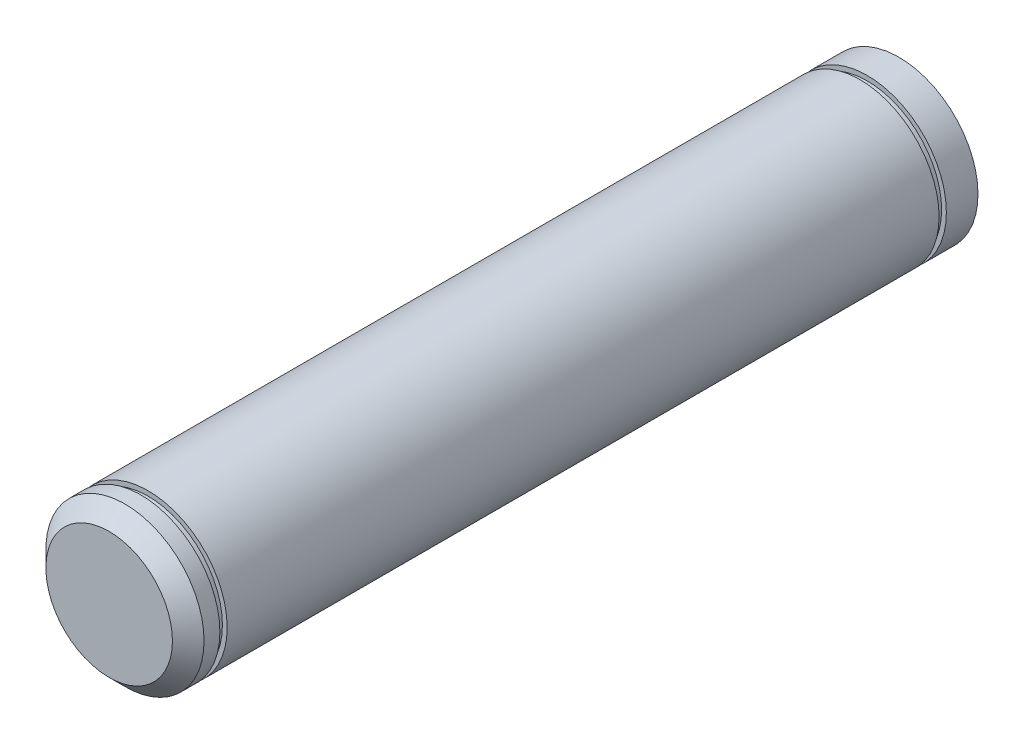
ISO-10303-21;
HEADER;
FILE_DESCRIPTION(('STEP AP214'),'2;1');
FILE_NAME('part.step','',(''),(''),'','','');
FILE_SCHEMA(('AUTOMOTIVE_DESIGN { 1 0 10303 214 1 1 1 1 }'));
ENDSEC;
DATA;
#1=APPLICATION_CONTEXT('core data for automotive mechanical design processes');
#2=APPLICATION_PROTOCOL_DEFINITION('international standard','automotive_design',2000,#1);
#3=PRODUCT_CONTEXT('',#1,'mechanical');
#4=PRODUCT('Part','Part','',(#3));
#5=PRODUCT_RELATED_PRODUCT_CATEGORY('part','',(#4));
#6=PRODUCT_DEFINITION_FORMATION('','',#4);
#7=PRODUCT_DEFINITION_CONTEXT('part definition',#1,'design');
#8=PRODUCT_DEFINITION('design','',#6,#7);
#9=PRODUCT_DEFINITION_SHAPE('','',#8);
#10=(LENGTH_UNIT() NAMED_UNIT(*) SI_UNIT(.MILLI.,.METRE.));
#11=(NAMED_UNIT(*) PLANE_ANGLE_UNIT() SI_UNIT($,.RADIAN.));
#12=(NAMED_UNIT(*) SI_UNIT($,.STERADIAN.) SOLID_ANGLE_UNIT());
#13=UNCERTAINTY_MEASURE_WITH_UNIT(LENGTH_MEASURE(1.E-05),#10,'distance_accuracy_value','');
#14=(GEOMETRIC_REPRESENTATION_CONTEXT(3) GLOBAL_UNCERTAINTY_ASSIGNED_CONTEXT((#13)) GLOBAL_UNIT_ASSIGNED_CONTEXT((#10,
#11,#12)) REPRESENTATION_CONTEXT('',''));
#15=CARTESIAN_POINT('',(0.,0.,0.));
#16=DIRECTION('',(0.,0.,1.));
#17=DIRECTION('',(1.,0.,0.));
#18=AXIS2_PLACEMENT_3D('',#15,#16,#17);
#19=CARTESIAN_POINT('',(0.,0.,304.8));
#20=DIRECTION('',(0.,0.,-1.));
#21=DIRECTION('',(-1.,0.,0.));
#22=AXIS2_PLACEMENT_3D('',#19,#20,#21);
#23=CYLINDRICAL_SURFACE('',#22,12.7);
#24=CARTESIAN_POINT('',(0.,0.,298.5516));
#25=DIRECTION('',(0.,0.,1.));
#26=DIRECTION('',(1.,0.,0.));
#27=AXIS2_PLACEMENT_3D('',#24,#25,#26);
#28=CIRCLE('',#27,12.7);
#29=CARTESIAN_POINT('',(12.7,0.,298.5516));
#30=VERTEX_POINT('',#29);
#31=EDGE_CURVE('E47',#30,#30,#28,.T.);
#32=ORIENTED_EDGE('',*,*,#31,.F.);
#33=EDGE_LOOP('',(#32));
#34=FACE_BOUND('',#33,.T.);
#35=CARTESIAN_POINT('',(0.,0.,184.248400108));
#36=DIRECTION('',(0.,0.,1.));
#37=DIRECTION('',(1.,0.,0.));
#38=AXIS2_PLACEMENT_3D('',#35,#36,#37);
#39=CIRCLE('',#38,12.7);
#40=CARTESIAN_POINT('',(12.7,0.,184.248400108));
#41=VERTEX_POINT('',#40);
#42=EDGE_CURVE('E59',#41,#41,#39,.T.);
#43=ORIENTED_EDGE('',*,*,#42,.T.);
#44=EDGE_LOOP('',(#43));
#45=FACE_BOUND('',#44,.T.);
#46=ADVANCED_FACE('F32',(#34,#45),#23,.T.);
#47=CARTESIAN_POINT('',(0.,0.,299.72));
#48=DIRECTION('',(0.,0.,1.));
#49=DIRECTION('',(1.,0.,0.));
#50=AXIS2_PLACEMENT_3D('',#47,#48,#49);
#51=CIRCLE('',#50,12.7);
#52=CARTESIAN_POINT('',(12.7,0.,299.72));
#53=VERTEX_POINT('',#52);
#54=EDGE_CURVE('E50',#53,#53,#51,.T.);
#55=ORIENTED_EDGE('',*,*,#54,.T.);
#56=EDGE_LOOP('',(#55));
#57=FACE_BOUND('',#56,.T.);
#58=CARTESIAN_POINT('',(0.,0.,302.26));
#59=DIRECTION('',(0.,0.,1.));
#60=DIRECTION('',(1.,0.,0.));
#61=AXIS2_PLACEMENT_3D('',#58,#59,#60);
#62=CIRCLE('',#61,12.7);
#63=CARTESIAN_POINT('',(12.7,0.,302.26));
#64=VERTEX_POINT('',#63);
#65=EDGE_CURVE('E39',#64,#64,#62,.F.);
#66=ORIENTED_EDGE('',*,*,#65,.T.);
#67=EDGE_LOOP('',(#66));
#68=FACE_BOUND('',#67,.T.);
#69=ADVANCED_FACE('F95',(#57,#68),#23,.T.);
#70=CARTESIAN_POINT('',(0.,0.,304.8));
#71=DIRECTION('',(0.,0.,1.));
#72=DIRECTION('',(1.,0.,0.));
#73=AXIS2_PLACEMENT_3D('',#70,#71,#72);
#74=PLANE('',#73);
#75=CARTESIAN_POINT('',(0.,0.,304.8));
#76=DIRECTION('',(0.,0.,1.));
#77=DIRECTION('',(1.,0.,0.));
#78=AXIS2_PLACEMENT_3D('',#75,#76,#77);
#79=CIRCLE('',#78,10.1600000000003);
#80=CARTESIAN_POINT('',(10.1600000000003,0.,304.8));
#81=VERTEX_POINT('',#80);
#82=EDGE_CURVE('E10',#81,#81,#79,.T.);
#83=ORIENTED_EDGE('',*,*,#82,.T.);
#84=EDGE_LOOP('',(#83));
#85=FACE_BOUND('',#84,.T.);
#86=ADVANCED_FACE('F101',(#85),#74,.T.);
#87=CARTESIAN_POINT('',(0.,0.,304.8));
#88=DIRECTION('',(0.,0.,-1.));
#89=DIRECTION('',(-1.,0.,0.));
#90=AXIS2_PLACEMENT_3D('',#87,#88,#89);
#91=CONICAL_SURFACE('',#90,10.1600000000003,0.785398163397451);
#92=ORIENTED_EDGE('',*,*,#65,.F.);
#93=EDGE_LOOP('',(#92));
#94=FACE_BOUND('',#93,.T.);
#95=ORIENTED_EDGE('',*,*,#82,.F.);
#96=EDGE_LOOP('',(#95));
#97=FACE_BOUND('',#96,.T.);
#98=ADVANCED_FACE('F34',(#94,#97),#91,.T.);
#99=CARTESIAN_POINT('',(0.,0.,298.5516));
#100=DIRECTION('',(0.,0.,1.));
#101=DIRECTION('',(1.,0.,0.));
#102=AXIS2_PLACEMENT_3D('',#99,#100,#101);
#103=PLANE('',#102);
#104=CARTESIAN_POINT('',(0.,0.,298.5516));
#105=DIRECTION('',(0.,0.,1.));
#106=DIRECTION('',(1.,0.,0.));
#107=AXIS2_PLACEMENT_3D('',#104,#105,#106);
#108=CIRCLE('',#107,11.938);
#109=CARTESIAN_POINT('',(11.938,0.,298.5516));
#110=VERTEX_POINT('',#109);
#111=EDGE_CURVE('E53',#110,#110,#108,.T.);
#112=ORIENTED_EDGE('',*,*,#111,.F.);
#113=EDGE_LOOP('',(#112));
#114=FACE_BOUND('',#113,.T.);
#115=ORIENTED_EDGE('',*,*,#31,.T.);
#116=EDGE_LOOP('',(#115));
#117=FACE_BOUND('',#116,.T.);
#118=ADVANCED_FACE('F125',(#114,#117),#103,.T.);
#119=CARTESIAN_POINT('',(0.,0.,299.72));
#120=DIRECTION('',(0.,0.,1.));
#121=DIRECTION('',(1.,0.,0.));
#122=AXIS2_PLACEMENT_3D('',#119,#120,#121);
#123=PLANE('',#122);
#124=CARTESIAN_POINT('',(0.,0.,299.72));
#125=DIRECTION('',(0.,0.,1.));
#126=DIRECTION('',(1.,0.,0.));
#127=AXIS2_PLACEMENT_3D('',#124,#125,#126);
#128=CIRCLE('',#127,11.938);
#129=CARTESIAN_POINT('',(11.938,0.,299.72));
#130=VERTEX_POINT('',#129);
#131=EDGE_CURVE('E56',#130,#130,#128,.T.);
#132=ORIENTED_EDGE('',*,*,#131,.T.);
#133=EDGE_LOOP('',(#132));
#134=FACE_BOUND('',#133,.T.);
#135=ORIENTED_EDGE('',*,*,#54,.F.);
#136=EDGE_LOOP('',(#135));
#137=FACE_BOUND('',#136,.T.);
#138=ADVANCED_FACE('F119',(#134,#137),#123,.F.);
#139=CARTESIAN_POINT('',(0.,0.,298.5516));
#140=DIRECTION('',(0.,0.,1.));
#141=DIRECTION('',(1.,0.,0.));
#142=AXIS2_PLACEMENT_3D('',#139,#140,#141);
#143=CYLINDRICAL_SURFACE('',#142,11.938);
#144=ORIENTED_EDGE('',*,*,#111,.T.);
#145=EDGE_LOOP('',(#144));
#146=FACE_BOUND('',#145,.T.);
#147=ORIENTED_EDGE('',*,*,#131,.F.);
#148=EDGE_LOOP('',(#147));
#149=FACE_BOUND('',#148,.T.);
#150=ADVANCED_FACE('F90',(#146,#149),#143,.T.);
#151=CARTESIAN_POINT('',(0.,0.,184.248400108));
#152=DIRECTION('',(0.,0.,-1.));
#153=DIRECTION('',(1.,0.,0.));
#154=AXIS2_PLACEMENT_3D('',#151,#152,#153);
#155=PLANE('',#154);
#156=ORIENTED_EDGE('',*,*,#42,.F.);
#157=EDGE_LOOP('',(#156));
#158=FACE_BOUND('',#157,.T.);
#159=CARTESIAN_POINT('',(0.,0.,184.248400108));
#160=DIRECTION('',(0.,0.,1.));
#161=DIRECTION('',(1.,0.,0.));
#162=AXIS2_PLACEMENT_3D('',#159,#160,#161);
#163=CIRCLE('',#162,11.938);
#164=CARTESIAN_POINT('',(11.938,0.,184.248400108));
#165=VERTEX_POINT('',#164);
#166=EDGE_CURVE('E65',#165,#165,#163,.T.);
#167=ORIENTED_EDGE('',*,*,#166,.T.);
#168=EDGE_LOOP('',(#167));
#169=FACE_BOUND('',#168,.T.);
#170=ADVANCED_FACE('F74',(#158,#169),#155,.T.);
#171=CARTESIAN_POINT('',(0.,0.,183.080000108));
#172=DIRECTION('',(0.,0.,-1.));
#173=DIRECTION('',(1.,0.,0.));
#174=AXIS2_PLACEMENT_3D('',#171,#172,#173);
#175=PLANE('',#174);
#176=CARTESIAN_POINT('',(0.,0.,183.080000108));
#177=DIRECTION('',(0.,0.,1.));
#178=DIRECTION('',(1.,0.,0.));
#179=AXIS2_PLACEMENT_3D('',#176,#177,#178);
#180=CIRCLE('',#179,12.7);
#181=CARTESIAN_POINT('',(12.7,0.,183.080000108));
#182=VERTEX_POINT('',#181);
#183=EDGE_CURVE('E62',#182,#182,#180,.T.);
#184=ORIENTED_EDGE('',*,*,#183,.T.);
#185=EDGE_LOOP('',(#184));
#186=FACE_BOUND('',#185,.T.);
#187=CARTESIAN_POINT('',(0.,0.,183.080000108));
#188=DIRECTION('',(0.,0.,1.));
#189=DIRECTION('',(1.,0.,0.));
#190=AXIS2_PLACEMENT_3D('',#187,#188,#189);
#191=CIRCLE('',#190,11.938);
#192=CARTESIAN_POINT('',(11.938,0.,183.080000108));
#193=VERTEX_POINT('',#192);
#194=EDGE_CURVE('E68',#193,#193,#191,.T.);
#195=ORIENTED_EDGE('',*,*,#194,.F.);
#196=EDGE_LOOP('',(#195));
#197=FACE_BOUND('',#196,.T.);
#198=ADVANCED_FACE('F80',(#186,#197),#175,.F.);
#199=CARTESIAN_POINT('',(0.,0.,184.248400108));
#200=DIRECTION('',(0.,0.,-1.));
#201=DIRECTION('',(-1.,0.,0.));
#202=AXIS2_PLACEMENT_3D('',#199,#200,#201);
#203=CYLINDRICAL_SURFACE('',#202,11.938);
#204=ORIENTED_EDGE('',*,*,#166,.F.);
#205=EDGE_LOOP('',(#204));
#206=FACE_BOUND('',#205,.T.);
#207=ORIENTED_EDGE('',*,*,#194,.T.);
#208=EDGE_LOOP('',(#207));
#209=FACE_BOUND('',#208,.T.);
#210=ADVANCED_FACE('F76',(#206,#209),#203,.T.);
#211=CARTESIAN_POINT('',(0.,0.,178.000000108));
#212=DIRECTION('',(0.,0.,1.));
#213=DIRECTION('',(1.,0.,0.));
#214=AXIS2_PLACEMENT_3D('',#211,#212,#213);
#215=PLANE('',#214);
#216=CARTESIAN_POINT('',(0.,0.,178.000000108));
#217=DIRECTION('',(0.,0.,1.));
#218=DIRECTION('',(1.,0.,0.));
#219=AXIS2_PLACEMENT_3D('',#216,#217,#218);
#220=CIRCLE('',#219,12.7);
#221=CARTESIAN_POINT('',(12.7,0.,178.000000108));
#222=VERTEX_POINT('',#221);
#223=EDGE_CURVE('E43',#222,#222,#220,.T.);
#224=ORIENTED_EDGE('',*,*,#223,.F.);
#225=EDGE_LOOP('',(#224));
#226=FACE_BOUND('',#225,.T.);
#227=ADVANCED_FACE('F79',(#226),#215,.F.);
#228=ORIENTED_EDGE('',*,*,#183,.F.);
#229=EDGE_LOOP('',(#228));
#230=FACE_BOUND('',#229,.T.);
#231=ORIENTED_EDGE('',*,*,#223,.T.);
#232=EDGE_LOOP('',(#231));
#233=FACE_BOUND('',#232,.T.);
#234=ADVANCED_FACE('F97',(#230,#233),#23,.T.);
#235=CLOSED_SHELL('',(#46,#69,#86,#98,#118,#138,#150,#170,#198,#210,#227,#234));
#236=MANIFOLD_SOLID_BREP('B2',#235);
#237=ADVANCED_BREP_SHAPE_REPRESENTATION('',(#18,#236),#14);
#238=SHAPE_DEFINITION_REPRESENTATION(#9,#237);
ENDSEC;
END-ISO-10303-21;
